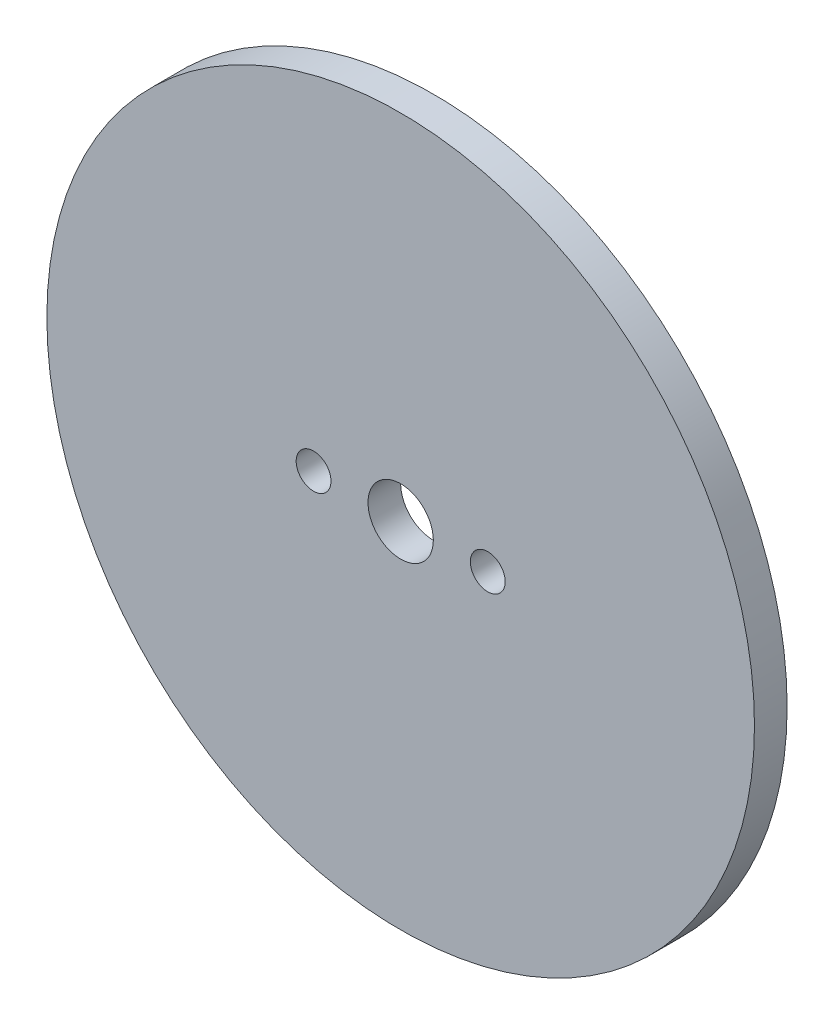
ISO-10303-21;
HEADER;
FILE_DESCRIPTION(('STEP AP214'),'2;1');
FILE_NAME('part.step','',(''),(''),'','','');
FILE_SCHEMA(('AUTOMOTIVE_DESIGN { 1 0 10303 214 1 1 1 1 }'));
ENDSEC;
DATA;
#1=APPLICATION_CONTEXT('core data for automotive mechanical design processes');
#2=APPLICATION_PROTOCOL_DEFINITION('international standard','automotive_design',2000,#1);
#3=PRODUCT_CONTEXT('',#1,'mechanical');
#4=PRODUCT('Part','Part','',(#3));
#5=PRODUCT_RELATED_PRODUCT_CATEGORY('part','',(#4));
#6=PRODUCT_DEFINITION_FORMATION('','',#4);
#7=PRODUCT_DEFINITION_CONTEXT('part definition',#1,'design');
#8=PRODUCT_DEFINITION('design','',#6,#7);
#9=PRODUCT_DEFINITION_SHAPE('','',#8);
#10=(LENGTH_UNIT() NAMED_UNIT(*) SI_UNIT(.MILLI.,.METRE.));
#11=(NAMED_UNIT(*) PLANE_ANGLE_UNIT() SI_UNIT($,.RADIAN.));
#12=(NAMED_UNIT(*) SI_UNIT($,.STERADIAN.) SOLID_ANGLE_UNIT());
#13=UNCERTAINTY_MEASURE_WITH_UNIT(LENGTH_MEASURE(1.E-05),#10,'distance_accuracy_value','');
#14=(GEOMETRIC_REPRESENTATION_CONTEXT(3) GLOBAL_UNCERTAINTY_ASSIGNED_CONTEXT((#13)) GLOBAL_UNIT_ASSIGNED_CONTEXT((#10,
#11,#12)) REPRESENTATION_CONTEXT('',''));
#15=CARTESIAN_POINT('',(0.,0.,0.));
#16=DIRECTION('',(0.,0.,1.));
#17=DIRECTION('',(1.,0.,0.));
#18=AXIS2_PLACEMENT_3D('',#15,#16,#17);
#19=CARTESIAN_POINT('',(0.,0.,3.));
#20=DIRECTION('',(0.,0.,1.));
#21=DIRECTION('',(1.,0.,0.));
#22=AXIS2_PLACEMENT_3D('',#19,#20,#21);
#23=PLANE('',#22);
#24=CARTESIAN_POINT('',(8.,0.,3.));
#25=DIRECTION('',(0.,0.,1.));
#26=DIRECTION('',(1.,0.,0.));
#27=AXIS2_PLACEMENT_3D('',#24,#25,#26);
#28=CIRCLE('',#27,1.6);
#29=CARTESIAN_POINT('',(9.6,0.,3.));
#30=VERTEX_POINT('',#29);
#31=EDGE_CURVE('E46',#30,#30,#28,.T.);
#32=ORIENTED_EDGE('',*,*,#31,.F.);
#33=EDGE_LOOP('',(#32));
#34=FACE_BOUND('',#33,.T.);
#35=CARTESIAN_POINT('',(0.,0.,3.));
#36=DIRECTION('',(0.,0.,1.));
#37=DIRECTION('',(1.,0.,0.));
#38=AXIS2_PLACEMENT_3D('',#35,#36,#37);
#39=CIRCLE('',#38,32.5);
#40=CARTESIAN_POINT('',(32.5,0.,3.));
#41=VERTEX_POINT('',#40);
#42=EDGE_CURVE('E10',#41,#41,#39,.T.);
#43=ORIENTED_EDGE('',*,*,#42,.T.);
#44=EDGE_LOOP('',(#43));
#45=FACE_BOUND('',#44,.T.);
#46=CARTESIAN_POINT('',(0.,0.,3.));
#47=DIRECTION('',(0.,0.,1.));
#48=DIRECTION('',(1.,0.,0.));
#49=AXIS2_PLACEMENT_3D('',#46,#47,#48);
#50=CIRCLE('',#49,3.);
#51=CARTESIAN_POINT('',(3.,0.,3.));
#52=VERTEX_POINT('',#51);
#53=EDGE_CURVE('E41',#52,#52,#50,.T.);
#54=ORIENTED_EDGE('',*,*,#53,.F.);
#55=EDGE_LOOP('',(#54));
#56=FACE_BOUND('',#55,.T.);
#57=CARTESIAN_POINT('',(-8.,0.,3.));
#58=DIRECTION('',(0.,0.,1.));
#59=DIRECTION('',(1.,0.,0.));
#60=AXIS2_PLACEMENT_3D('',#57,#58,#59);
#61=CIRCLE('',#60,1.6);
#62=CARTESIAN_POINT('',(-6.4,0.,3.));
#63=VERTEX_POINT('',#62);
#64=EDGE_CURVE('E52',#63,#63,#61,.T.);
#65=ORIENTED_EDGE('',*,*,#64,.F.);
#66=EDGE_LOOP('',(#65));
#67=FACE_BOUND('',#66,.T.);
#68=ADVANCED_FACE('F30',(#34,#45,#56,#67),#23,.T.);
#69=CARTESIAN_POINT('',(0.,0.,0.));
#70=DIRECTION('',(0.,0.,1.));
#71=DIRECTION('',(1.,0.,0.));
#72=AXIS2_PLACEMENT_3D('',#69,#70,#71);
#73=PLANE('',#72);
#74=CARTESIAN_POINT('',(0.,0.,0.));
#75=DIRECTION('',(0.,0.,1.));
#76=DIRECTION('',(1.,0.,0.));
#77=AXIS2_PLACEMENT_3D('',#74,#75,#76);
#78=CIRCLE('',#77,32.5);
#79=CARTESIAN_POINT('',(32.5,0.,0.));
#80=VERTEX_POINT('',#79);
#81=EDGE_CURVE('E34',#80,#80,#78,.T.);
#82=ORIENTED_EDGE('',*,*,#81,.F.);
#83=EDGE_LOOP('',(#82));
#84=FACE_BOUND('',#83,.T.);
#85=CARTESIAN_POINT('',(0.,0.,0.));
#86=DIRECTION('',(0.,0.,1.));
#87=DIRECTION('',(1.,0.,0.));
#88=AXIS2_PLACEMENT_3D('',#85,#86,#87);
#89=CIRCLE('',#88,3.);
#90=CARTESIAN_POINT('',(3.,0.,0.));
#91=VERTEX_POINT('',#90);
#92=EDGE_CURVE('E43',#91,#91,#89,.T.);
#93=ORIENTED_EDGE('',*,*,#92,.T.);
#94=EDGE_LOOP('',(#93));
#95=FACE_BOUND('',#94,.T.);
#96=CARTESIAN_POINT('',(8.,0.,0.));
#97=DIRECTION('',(0.,0.,1.));
#98=DIRECTION('',(1.,0.,0.));
#99=AXIS2_PLACEMENT_3D('',#96,#97,#98);
#100=CIRCLE('',#99,1.6);
#101=CARTESIAN_POINT('',(9.6,0.,0.));
#102=VERTEX_POINT('',#101);
#103=EDGE_CURVE('E49',#102,#102,#100,.T.);
#104=ORIENTED_EDGE('',*,*,#103,.T.);
#105=EDGE_LOOP('',(#104));
#106=FACE_BOUND('',#105,.T.);
#107=CARTESIAN_POINT('',(-8.,0.,0.));
#108=DIRECTION('',(0.,0.,1.));
#109=DIRECTION('',(1.,0.,0.));
#110=AXIS2_PLACEMENT_3D('',#107,#108,#109);
#111=CIRCLE('',#110,1.6);
#112=CARTESIAN_POINT('',(-6.4,0.,0.));
#113=VERTEX_POINT('',#112);
#114=EDGE_CURVE('E55',#113,#113,#111,.T.);
#115=ORIENTED_EDGE('',*,*,#114,.T.);
#116=EDGE_LOOP('',(#115));
#117=FACE_BOUND('',#116,.T.);
#118=ADVANCED_FACE('F65',(#84,#95,#106,#117),#73,.F.);
#119=CARTESIAN_POINT('',(0.,0.,3.));
#120=DIRECTION('',(0.,0.,-1.));
#121=DIRECTION('',(-1.,0.,0.));
#122=AXIS2_PLACEMENT_3D('',#119,#120,#121);
#123=CYLINDRICAL_SURFACE('',#122,32.5);
#124=ORIENTED_EDGE('',*,*,#42,.F.);
#125=EDGE_LOOP('',(#124));
#126=FACE_BOUND('',#125,.T.);
#127=ORIENTED_EDGE('',*,*,#81,.T.);
#128=EDGE_LOOP('',(#127));
#129=FACE_BOUND('',#128,.T.);
#130=ADVANCED_FACE('F32',(#126,#129),#123,.T.);
#131=CARTESIAN_POINT('',(0.,0.,3.));
#132=DIRECTION('',(0.,0.,-1.));
#133=DIRECTION('',(-1.,0.,0.));
#134=AXIS2_PLACEMENT_3D('',#131,#132,#133);
#135=CYLINDRICAL_SURFACE('',#134,3.);
#136=ORIENTED_EDGE('',*,*,#53,.T.);
#137=EDGE_LOOP('',(#136));
#138=FACE_BOUND('',#137,.T.);
#139=ORIENTED_EDGE('',*,*,#92,.F.);
#140=EDGE_LOOP('',(#139));
#141=FACE_BOUND('',#140,.T.);
#142=ADVANCED_FACE('F74',(#138,#141),#135,.F.);
#143=CARTESIAN_POINT('',(8.,0.,3.));
#144=DIRECTION('',(0.,0.,-1.));
#145=DIRECTION('',(-1.,0.,0.));
#146=AXIS2_PLACEMENT_3D('',#143,#144,#145);
#147=CYLINDRICAL_SURFACE('',#146,1.6);
#148=ORIENTED_EDGE('',*,*,#31,.T.);
#149=EDGE_LOOP('',(#148));
#150=FACE_BOUND('',#149,.T.);
#151=ORIENTED_EDGE('',*,*,#103,.F.);
#152=EDGE_LOOP('',(#151));
#153=FACE_BOUND('',#152,.T.);
#154=ADVANCED_FACE('F77',(#150,#153),#147,.F.);
#155=CARTESIAN_POINT('',(-8.,0.,3.));
#156=DIRECTION('',(0.,0.,-1.));
#157=DIRECTION('',(-1.,0.,0.));
#158=AXIS2_PLACEMENT_3D('',#155,#156,#157);
#159=CYLINDRICAL_SURFACE('',#158,1.6);
#160=ORIENTED_EDGE('',*,*,#64,.T.);
#161=EDGE_LOOP('',(#160));
#162=FACE_BOUND('',#161,.T.);
#163=ORIENTED_EDGE('',*,*,#114,.F.);
#164=EDGE_LOOP('',(#163));
#165=FACE_BOUND('',#164,.T.);
#166=ADVANCED_FACE('F61',(#162,#165),#159,.F.);
#167=CLOSED_SHELL('',(#68,#118,#130,#142,#154,#166));
#168=MANIFOLD_SOLID_BREP('B2',#167);
#169=ADVANCED_BREP_SHAPE_REPRESENTATION('',(#18,#168),#14);
#170=SHAPE_DEFINITION_REPRESENTATION(#9,#169);
ENDSEC;
END-ISO-10303-21;
